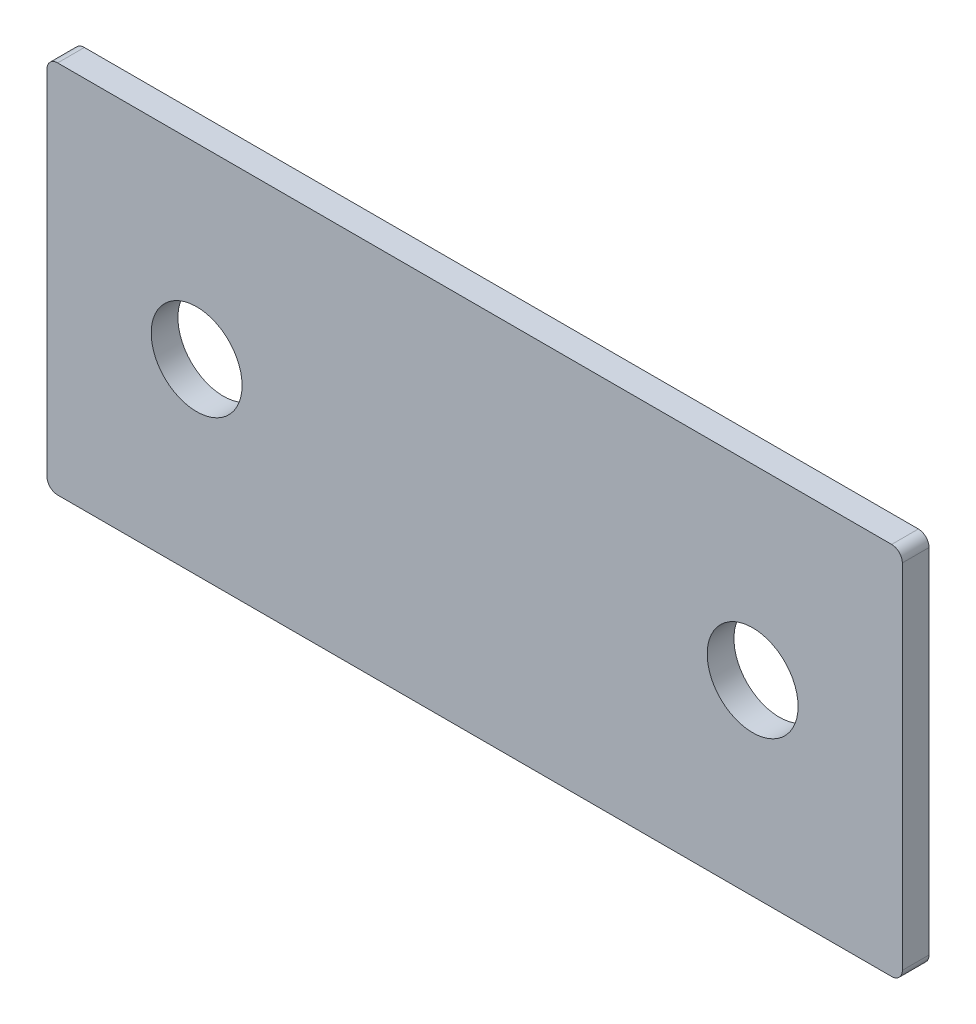
ISO-10303-21;
HEADER;
FILE_DESCRIPTION(('STEP AP214'),'2;1');
FILE_NAME('part.step','',(''),(''),'','','');
FILE_SCHEMA(('AUTOMOTIVE_DESIGN { 1 0 10303 214 1 1 1 1 }'));
ENDSEC;
DATA;
#1=APPLICATION_CONTEXT('core data for automotive mechanical design processes');
#2=APPLICATION_PROTOCOL_DEFINITION('international standard','automotive_design',2000,#1);
#3=PRODUCT_CONTEXT('',#1,'mechanical');
#4=PRODUCT('Part','Part','',(#3));
#5=PRODUCT_RELATED_PRODUCT_CATEGORY('part','',(#4));
#6=PRODUCT_DEFINITION_FORMATION('','',#4);
#7=PRODUCT_DEFINITION_CONTEXT('part definition',#1,'design');
#8=PRODUCT_DEFINITION('design','',#6,#7);
#9=PRODUCT_DEFINITION_SHAPE('','',#8);
#10=(LENGTH_UNIT() NAMED_UNIT(*) SI_UNIT(.MILLI.,.METRE.));
#11=(NAMED_UNIT(*) PLANE_ANGLE_UNIT() SI_UNIT($,.RADIAN.));
#12=(NAMED_UNIT(*) SI_UNIT($,.STERADIAN.) SOLID_ANGLE_UNIT());
#13=UNCERTAINTY_MEASURE_WITH_UNIT(LENGTH_MEASURE(1.E-05),#10,'distance_accuracy_value','');
#14=(GEOMETRIC_REPRESENTATION_CONTEXT(3) GLOBAL_UNCERTAINTY_ASSIGNED_CONTEXT((#13)) GLOBAL_UNIT_ASSIGNED_CONTEXT((#10,
#11,#12)) REPRESENTATION_CONTEXT('',''));
#15=CARTESIAN_POINT('',(0.,0.,0.));
#16=DIRECTION('',(0.,0.,1.));
#17=DIRECTION('',(1.,0.,0.));
#18=AXIS2_PLACEMENT_3D('',#15,#16,#17);
#19=CARTESIAN_POINT('',(0.,0.,2.5));
#20=DIRECTION('',(0.,0.,-1.));
#21=DIRECTION('',(-1.,0.,0.));
#22=AXIS2_PLACEMENT_3D('',#19,#20,#21);
#23=PLANE('',#22);
#24=DIRECTION('',(0.,-1.,0.));
#25=VECTOR('',#24,1.);
#26=CARTESIAN_POINT('',(-40.,-17.5,2.5));
#27=LINE('',#26,#25);
#28=CARTESIAN_POINT('',(-40.,16.5,2.5));
#29=VERTEX_POINT('',#28);
#30=CARTESIAN_POINT('',(-40.,-16.5,2.5));
#31=VERTEX_POINT('',#30);
#32=EDGE_CURVE('E173',#29,#31,#27,.T.);
#33=ORIENTED_EDGE('',*,*,#32,.T.);
#34=CARTESIAN_POINT('',(-39.,-16.5,2.5));
#35=DIRECTION('',(0.,0.,-1.));
#36=DIRECTION('',(-1.,0.,0.));
#37=AXIS2_PLACEMENT_3D('',#34,#35,#36);
#38=CIRCLE('',#37,1.);
#39=CARTESIAN_POINT('',(-39.,-17.5,2.5));
#40=VERTEX_POINT('',#39);
#41=EDGE_CURVE('E150',#31,#40,#38,.F.);
#42=ORIENTED_EDGE('',*,*,#41,.T.);
#43=DIRECTION('',(1.,0.,0.));
#44=VECTOR('',#43,1.);
#45=CARTESIAN_POINT('',(-40.,-17.5,2.5));
#46=LINE('',#45,#44);
#47=CARTESIAN_POINT('',(39.,-17.5,2.5));
#48=VERTEX_POINT('',#47);
#49=EDGE_CURVE('E121',#40,#48,#46,.T.);
#50=ORIENTED_EDGE('',*,*,#49,.T.);
#51=CARTESIAN_POINT('',(39.,-16.5,2.5));
#52=DIRECTION('',(0.,0.,-1.));
#53=DIRECTION('',(-1.,0.,0.));
#54=AXIS2_PLACEMENT_3D('',#51,#52,#53);
#55=CIRCLE('',#54,1.);
#56=CARTESIAN_POINT('',(40.,-16.5,2.5));
#57=VERTEX_POINT('',#56);
#58=EDGE_CURVE('E146',#48,#57,#55,.F.);
#59=ORIENTED_EDGE('',*,*,#58,.T.);
#60=DIRECTION('',(0.,1.,0.));
#61=VECTOR('',#60,1.);
#62=CARTESIAN_POINT('',(40.,-17.5,2.5));
#63=LINE('',#62,#61);
#64=CARTESIAN_POINT('',(40.,16.5,2.5));
#65=VERTEX_POINT('',#64);
#66=EDGE_CURVE('E129',#57,#65,#63,.T.);
#67=ORIENTED_EDGE('',*,*,#66,.T.);
#68=CARTESIAN_POINT('',(39.,16.5,2.5));
#69=DIRECTION('',(0.,0.,-1.));
#70=DIRECTION('',(-1.,0.,0.));
#71=AXIS2_PLACEMENT_3D('',#68,#69,#70);
#72=CIRCLE('',#71,1.);
#73=CARTESIAN_POINT('',(39.,17.5,2.5));
#74=VERTEX_POINT('',#73);
#75=EDGE_CURVE('E56',#65,#74,#72,.F.);
#76=ORIENTED_EDGE('',*,*,#75,.T.);
#77=DIRECTION('',(-1.,0.,0.));
#78=VECTOR('',#77,1.);
#79=CARTESIAN_POINT('',(-40.,17.5,2.5));
#80=LINE('',#79,#78);
#81=CARTESIAN_POINT('',(-39.,17.5,2.5));
#82=VERTEX_POINT('',#81);
#83=EDGE_CURVE('E132',#74,#82,#80,.T.);
#84=ORIENTED_EDGE('',*,*,#83,.T.);
#85=CARTESIAN_POINT('',(-39.,16.5,2.5));
#86=DIRECTION('',(0.,0.,-1.));
#87=DIRECTION('',(-1.,0.,0.));
#88=AXIS2_PLACEMENT_3D('',#85,#86,#87);
#89=CIRCLE('',#88,1.);
#90=EDGE_CURVE('E148',#82,#29,#89,.F.);
#91=ORIENTED_EDGE('',*,*,#90,.T.);
#92=EDGE_LOOP('',(#33,#42,#50,#59,#67,#76,#84,#91));
#93=FACE_BOUND('',#92,.T.);
#94=CARTESIAN_POINT('',(-26.,0.,2.5));
#95=DIRECTION('',(0.,0.,1.));
#96=DIRECTION('',(1.,0.,0.));
#97=AXIS2_PLACEMENT_3D('',#94,#95,#96);
#98=CIRCLE('',#97,4.25);
#99=CARTESIAN_POINT('',(-21.75,0.,2.5));
#100=VERTEX_POINT('',#99);
#101=EDGE_CURVE('E169',#100,#100,#98,.T.);
#102=ORIENTED_EDGE('',*,*,#101,.F.);
#103=EDGE_LOOP('',(#102));
#104=FACE_BOUND('',#103,.T.);
#105=CARTESIAN_POINT('',(26.,0.,2.5));
#106=DIRECTION('',(0.,0.,1.));
#107=DIRECTION('',(1.,0.,0.));
#108=AXIS2_PLACEMENT_3D('',#105,#106,#107);
#109=CIRCLE('',#108,4.25);
#110=CARTESIAN_POINT('',(30.25,0.,2.5));
#111=VERTEX_POINT('',#110);
#112=EDGE_CURVE('E179',#111,#111,#109,.T.);
#113=ORIENTED_EDGE('',*,*,#112,.F.);
#114=EDGE_LOOP('',(#113));
#115=FACE_BOUND('',#114,.T.);
#116=ADVANCED_FACE('F34',(#93,#104,#115),#23,.F.);
#117=CARTESIAN_POINT('',(0.,0.,0.));
#118=DIRECTION('',(0.,0.,-1.));
#119=DIRECTION('',(-1.,0.,0.));
#120=AXIS2_PLACEMENT_3D('',#117,#118,#119);
#121=PLANE('',#120);
#122=CARTESIAN_POINT('',(-26.,0.,0.));
#123=DIRECTION('',(0.,0.,1.));
#124=DIRECTION('',(1.,0.,0.));
#125=AXIS2_PLACEMENT_3D('',#122,#123,#124);
#126=CIRCLE('',#125,4.25);
#127=CARTESIAN_POINT('',(-21.75,0.,0.));
#128=VERTEX_POINT('',#127);
#129=EDGE_CURVE('E176',#128,#128,#126,.T.);
#130=ORIENTED_EDGE('',*,*,#129,.T.);
#131=EDGE_LOOP('',(#130));
#132=FACE_BOUND('',#131,.T.);
#133=DIRECTION('',(1.,0.,0.));
#134=VECTOR('',#133,1.);
#135=CARTESIAN_POINT('',(-40.,-17.5,0.));
#136=LINE('',#135,#134);
#137=CARTESIAN_POINT('',(-39.,-17.5,0.));
#138=VERTEX_POINT('',#137);
#139=CARTESIAN_POINT('',(39.,-17.5,0.));
#140=VERTEX_POINT('',#139);
#141=EDGE_CURVE('E118',#138,#140,#136,.T.);
#142=ORIENTED_EDGE('',*,*,#141,.F.);
#143=CARTESIAN_POINT('',(-39.,-16.5,0.));
#144=DIRECTION('',(0.,0.,-1.));
#145=DIRECTION('',(-1.,0.,0.));
#146=AXIS2_PLACEMENT_3D('',#143,#144,#145);
#147=CIRCLE('',#146,1.);
#148=CARTESIAN_POINT('',(-40.,-16.5,0.));
#149=VERTEX_POINT('',#148);
#150=EDGE_CURVE('E101',#138,#149,#147,.T.);
#151=ORIENTED_EDGE('',*,*,#150,.T.);
#152=DIRECTION('',(0.,-1.,0.));
#153=VECTOR('',#152,1.);
#154=CARTESIAN_POINT('',(-40.,-17.5,0.));
#155=LINE('',#154,#153);
#156=CARTESIAN_POINT('',(-40.,16.5,0.));
#157=VERTEX_POINT('',#156);
#158=EDGE_CURVE('E130',#157,#149,#155,.T.);
#159=ORIENTED_EDGE('',*,*,#158,.F.);
#160=CARTESIAN_POINT('',(-39.,16.5,0.));
#161=DIRECTION('',(0.,0.,-1.));
#162=DIRECTION('',(-1.,0.,0.));
#163=AXIS2_PLACEMENT_3D('',#160,#161,#162);
#164=CIRCLE('',#163,1.);
#165=CARTESIAN_POINT('',(-39.,17.5,0.));
#166=VERTEX_POINT('',#165);
#167=EDGE_CURVE('E112',#157,#166,#164,.T.);
#168=ORIENTED_EDGE('',*,*,#167,.T.);
#169=DIRECTION('',(-1.,0.,0.));
#170=VECTOR('',#169,1.);
#171=CARTESIAN_POINT('',(-40.,17.5,0.));
#172=LINE('',#171,#170);
#173=CARTESIAN_POINT('',(39.,17.5,0.));
#174=VERTEX_POINT('',#173);
#175=EDGE_CURVE('E134',#174,#166,#172,.T.);
#176=ORIENTED_EDGE('',*,*,#175,.F.);
#177=CARTESIAN_POINT('',(39.,16.5,0.));
#178=DIRECTION('',(0.,0.,-1.));
#179=DIRECTION('',(-1.,0.,0.));
#180=AXIS2_PLACEMENT_3D('',#177,#178,#179);
#181=CIRCLE('',#180,1.);
#182=CARTESIAN_POINT('',(40.,16.5,0.));
#183=VERTEX_POINT('',#182);
#184=EDGE_CURVE('E122',#174,#183,#181,.T.);
#185=ORIENTED_EDGE('',*,*,#184,.T.);
#186=DIRECTION('',(0.,1.,0.));
#187=VECTOR('',#186,1.);
#188=CARTESIAN_POINT('',(40.,-17.5,0.));
#189=LINE('',#188,#187);
#190=CARTESIAN_POINT('',(40.,-16.5,0.));
#191=VERTEX_POINT('',#190);
#192=EDGE_CURVE('E161',#191,#183,#189,.T.);
#193=ORIENTED_EDGE('',*,*,#192,.F.);
#194=CARTESIAN_POINT('',(39.,-16.5,0.));
#195=DIRECTION('',(0.,0.,-1.));
#196=DIRECTION('',(-1.,0.,0.));
#197=AXIS2_PLACEMENT_3D('',#194,#195,#196);
#198=CIRCLE('',#197,1.);
#199=EDGE_CURVE('E128',#191,#140,#198,.T.);
#200=ORIENTED_EDGE('',*,*,#199,.T.);
#201=EDGE_LOOP('',(#142,#151,#159,#168,#176,#185,#193,#200));
#202=FACE_BOUND('',#201,.T.);
#203=CARTESIAN_POINT('',(26.,0.,0.));
#204=DIRECTION('',(0.,0.,1.));
#205=DIRECTION('',(1.,0.,0.));
#206=AXIS2_PLACEMENT_3D('',#203,#204,#205);
#207=CIRCLE('',#206,4.25);
#208=CARTESIAN_POINT('',(30.25,0.,0.));
#209=VERTEX_POINT('',#208);
#210=EDGE_CURVE('E182',#209,#209,#207,.T.);
#211=ORIENTED_EDGE('',*,*,#210,.T.);
#212=EDGE_LOOP('',(#211));
#213=FACE_BOUND('',#212,.T.);
#214=ADVANCED_FACE('F125',(#132,#202,#213),#121,.T.);
#215=CARTESIAN_POINT('',(40.,-17.5,2.5));
#216=DIRECTION('',(-1.,0.,0.));
#217=DIRECTION('',(0.,0.,1.));
#218=AXIS2_PLACEMENT_3D('',#215,#216,#217);
#219=PLANE('',#218);
#220=ORIENTED_EDGE('',*,*,#66,.F.);
#221=DIRECTION('',(0.,0.,-1.));
#222=VECTOR('',#221,1.);
#223=CARTESIAN_POINT('',(40.,-16.5,2.5));
#224=LINE('',#223,#222);
#225=EDGE_CURVE('E11',#57,#191,#224,.T.);
#226=ORIENTED_EDGE('',*,*,#225,.T.);
#227=ORIENTED_EDGE('',*,*,#192,.T.);
#228=DIRECTION('',(0.,0.,-1.));
#229=VECTOR('',#228,1.);
#230=CARTESIAN_POINT('',(40.,16.5,2.5));
#231=LINE('',#230,#229);
#232=EDGE_CURVE('E42',#183,#65,#231,.F.);
#233=ORIENTED_EDGE('',*,*,#232,.T.);
#234=EDGE_LOOP('',(#220,#226,#227,#233));
#235=FACE_BOUND('',#234,.T.);
#236=ADVANCED_FACE('F159',(#235),#219,.F.);
#237=CARTESIAN_POINT('',(-40.,17.5,2.5));
#238=DIRECTION('',(0.,-1.,0.));
#239=DIRECTION('',(0.,0.,-1.));
#240=AXIS2_PLACEMENT_3D('',#237,#238,#239);
#241=PLANE('',#240);
#242=ORIENTED_EDGE('',*,*,#175,.T.);
#243=DIRECTION('',(0.,0.,-1.));
#244=VECTOR('',#243,1.);
#245=CARTESIAN_POINT('',(-39.,17.5,2.5));
#246=LINE('',#245,#244);
#247=EDGE_CURVE('E49',#166,#82,#246,.F.);
#248=ORIENTED_EDGE('',*,*,#247,.T.);
#249=ORIENTED_EDGE('',*,*,#83,.F.);
#250=DIRECTION('',(0.,0.,-1.));
#251=VECTOR('',#250,1.);
#252=CARTESIAN_POINT('',(39.,17.5,2.5));
#253=LINE('',#252,#251);
#254=EDGE_CURVE('E152',#74,#174,#253,.T.);
#255=ORIENTED_EDGE('',*,*,#254,.T.);
#256=EDGE_LOOP('',(#242,#248,#249,#255));
#257=FACE_BOUND('',#256,.T.);
#258=ADVANCED_FACE('F168',(#257),#241,.F.);
#259=CARTESIAN_POINT('',(-40.,-17.5,2.5));
#260=DIRECTION('',(1.,0.,0.));
#261=DIRECTION('',(0.,0.,-1.));
#262=AXIS2_PLACEMENT_3D('',#259,#260,#261);
#263=PLANE('',#262);
#264=ORIENTED_EDGE('',*,*,#158,.T.);
#265=DIRECTION('',(0.,0.,-1.));
#266=VECTOR('',#265,1.);
#267=CARTESIAN_POINT('',(-40.,-16.5,2.5));
#268=LINE('',#267,#266);
#269=EDGE_CURVE('E106',#149,#31,#268,.F.);
#270=ORIENTED_EDGE('',*,*,#269,.T.);
#271=ORIENTED_EDGE('',*,*,#32,.F.);
#272=DIRECTION('',(0.,0.,-1.));
#273=VECTOR('',#272,1.);
#274=CARTESIAN_POINT('',(-40.,16.5,2.5));
#275=LINE('',#274,#273);
#276=EDGE_CURVE('E111',#29,#157,#275,.T.);
#277=ORIENTED_EDGE('',*,*,#276,.T.);
#278=EDGE_LOOP('',(#264,#270,#271,#277));
#279=FACE_BOUND('',#278,.T.);
#280=ADVANCED_FACE('F204',(#279),#263,.F.);
#281=CARTESIAN_POINT('',(-40.,-17.5,2.5));
#282=DIRECTION('',(0.,1.,0.));
#283=DIRECTION('',(0.,0.,1.));
#284=AXIS2_PLACEMENT_3D('',#281,#282,#283);
#285=PLANE('',#284);
#286=ORIENTED_EDGE('',*,*,#49,.F.);
#287=DIRECTION('',(0.,0.,-1.));
#288=VECTOR('',#287,1.);
#289=CARTESIAN_POINT('',(-39.,-17.5,2.5));
#290=LINE('',#289,#288);
#291=EDGE_CURVE('E105',#40,#138,#290,.T.);
#292=ORIENTED_EDGE('',*,*,#291,.T.);
#293=ORIENTED_EDGE('',*,*,#141,.T.);
#294=DIRECTION('',(0.,0.,-1.));
#295=VECTOR('',#294,1.);
#296=CARTESIAN_POINT('',(39.,-17.5,2.5));
#297=LINE('',#296,#295);
#298=EDGE_CURVE('E123',#140,#48,#297,.F.);
#299=ORIENTED_EDGE('',*,*,#298,.T.);
#300=EDGE_LOOP('',(#286,#292,#293,#299));
#301=FACE_BOUND('',#300,.T.);
#302=ADVANCED_FACE('F117',(#301),#285,.F.);
#303=CARTESIAN_POINT('',(-26.,0.,2.5));
#304=DIRECTION('',(0.,0.,-1.));
#305=DIRECTION('',(-1.,0.,0.));
#306=AXIS2_PLACEMENT_3D('',#303,#304,#305);
#307=CYLINDRICAL_SURFACE('',#306,4.25);
#308=ORIENTED_EDGE('',*,*,#101,.T.);
#309=EDGE_LOOP('',(#308));
#310=FACE_BOUND('',#309,.T.);
#311=ORIENTED_EDGE('',*,*,#129,.F.);
#312=EDGE_LOOP('',(#311));
#313=FACE_BOUND('',#312,.T.);
#314=ADVANCED_FACE('F199',(#310,#313),#307,.F.);
#315=CARTESIAN_POINT('',(26.,0.,2.5));
#316=DIRECTION('',(0.,0.,-1.));
#317=DIRECTION('',(-1.,0.,0.));
#318=AXIS2_PLACEMENT_3D('',#315,#316,#317);
#319=CYLINDRICAL_SURFACE('',#318,4.25);
#320=ORIENTED_EDGE('',*,*,#112,.T.);
#321=EDGE_LOOP('',(#320));
#322=FACE_BOUND('',#321,.T.);
#323=ORIENTED_EDGE('',*,*,#210,.F.);
#324=EDGE_LOOP('',(#323));
#325=FACE_BOUND('',#324,.T.);
#326=ADVANCED_FACE('F188',(#322,#325),#319,.F.);
#327=CARTESIAN_POINT('',(-39.,-16.5,2.5));
#328=DIRECTION('',(0.,0.,-1.));
#329=DIRECTION('',(-1.,0.,0.));
#330=AXIS2_PLACEMENT_3D('',#327,#328,#329);
#331=CYLINDRICAL_SURFACE('',#330,1.);
#332=ORIENTED_EDGE('',*,*,#41,.F.);
#333=ORIENTED_EDGE('',*,*,#269,.F.);
#334=ORIENTED_EDGE('',*,*,#150,.F.);
#335=ORIENTED_EDGE('',*,*,#291,.F.);
#336=EDGE_LOOP('',(#332,#333,#334,#335));
#337=FACE_BOUND('',#336,.T.);
#338=ADVANCED_FACE('F104',(#337),#331,.T.);
#339=CARTESIAN_POINT('',(-39.,16.5,2.5));
#340=DIRECTION('',(0.,0.,-1.));
#341=DIRECTION('',(-1.,0.,0.));
#342=AXIS2_PLACEMENT_3D('',#339,#340,#341);
#343=CYLINDRICAL_SURFACE('',#342,1.);
#344=ORIENTED_EDGE('',*,*,#90,.F.);
#345=ORIENTED_EDGE('',*,*,#247,.F.);
#346=ORIENTED_EDGE('',*,*,#167,.F.);
#347=ORIENTED_EDGE('',*,*,#276,.F.);
#348=EDGE_LOOP('',(#344,#345,#346,#347));
#349=FACE_BOUND('',#348,.T.);
#350=ADVANCED_FACE('F214',(#349),#343,.T.);
#351=CARTESIAN_POINT('',(39.,-16.5,2.5));
#352=DIRECTION('',(0.,0.,-1.));
#353=DIRECTION('',(-1.,0.,0.));
#354=AXIS2_PLACEMENT_3D('',#351,#352,#353);
#355=CYLINDRICAL_SURFACE('',#354,1.);
#356=ORIENTED_EDGE('',*,*,#58,.F.);
#357=ORIENTED_EDGE('',*,*,#298,.F.);
#358=ORIENTED_EDGE('',*,*,#199,.F.);
#359=ORIENTED_EDGE('',*,*,#225,.F.);
#360=EDGE_LOOP('',(#356,#357,#358,#359));
#361=FACE_BOUND('',#360,.T.);
#362=ADVANCED_FACE('F216',(#361),#355,.T.);
#363=CARTESIAN_POINT('',(39.,16.5,2.5));
#364=DIRECTION('',(0.,0.,-1.));
#365=DIRECTION('',(-1.,0.,0.));
#366=AXIS2_PLACEMENT_3D('',#363,#364,#365);
#367=CYLINDRICAL_SURFACE('',#366,1.);
#368=ORIENTED_EDGE('',*,*,#75,.F.);
#369=ORIENTED_EDGE('',*,*,#232,.F.);
#370=ORIENTED_EDGE('',*,*,#184,.F.);
#371=ORIENTED_EDGE('',*,*,#254,.F.);
#372=EDGE_LOOP('',(#368,#369,#370,#371));
#373=FACE_BOUND('',#372,.T.);
#374=ADVANCED_FACE('F36',(#373),#367,.T.);
#375=CLOSED_SHELL('',(#116,#214,#236,#258,#280,#302,#314,#326,#338,#350,#362,#374));
#376=MANIFOLD_SOLID_BREP('B2',#375);
#377=ADVANCED_BREP_SHAPE_REPRESENTATION('',(#18,#376),#14);
#378=SHAPE_DEFINITION_REPRESENTATION(#9,#377);
ENDSEC;
END-ISO-10303-21;
